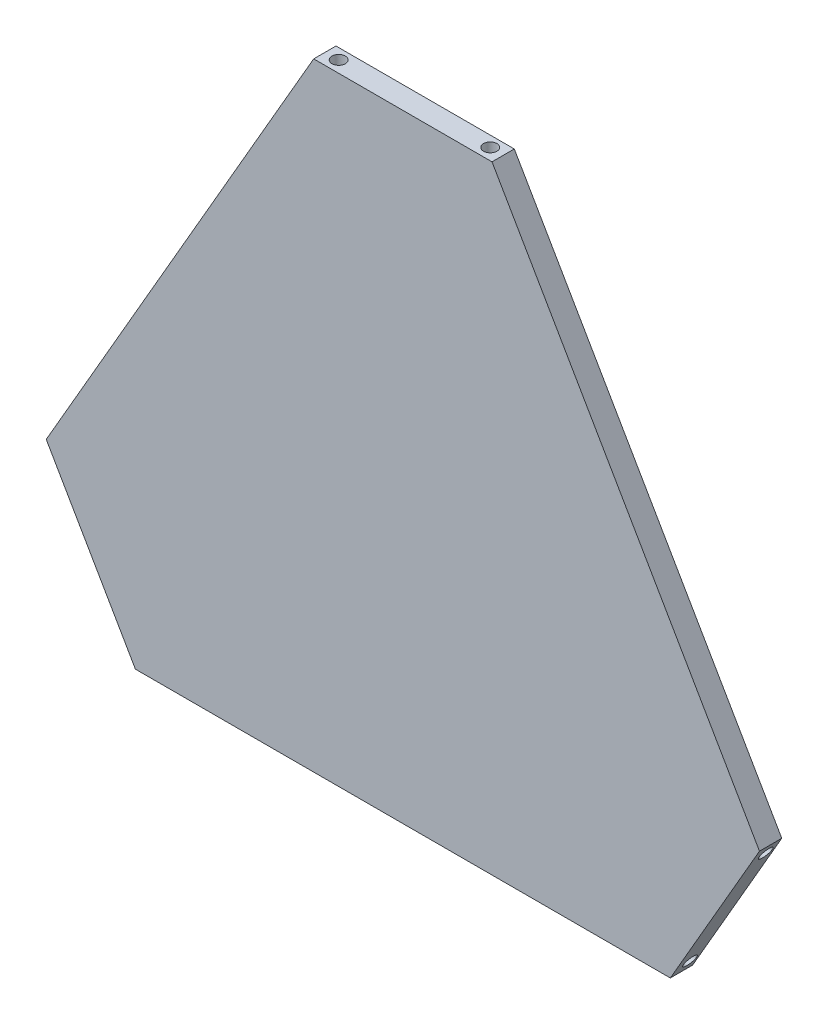
ISO-10303-21;
HEADER;
FILE_DESCRIPTION(('STEP AP214'),'2;1');
FILE_NAME('part.step','',(''),(''),'','','');
FILE_SCHEMA(('AUTOMOTIVE_DESIGN { 1 0 10303 214 1 1 1 1 }'));
ENDSEC;
DATA;
#1=APPLICATION_CONTEXT('core data for automotive mechanical design processes');
#2=APPLICATION_PROTOCOL_DEFINITION('international standard','automotive_design',2000,#1);
#3=PRODUCT_CONTEXT('',#1,'mechanical');
#4=PRODUCT('Part','Part','',(#3));
#5=PRODUCT_RELATED_PRODUCT_CATEGORY('part','',(#4));
#6=PRODUCT_DEFINITION_FORMATION('','',#4);
#7=PRODUCT_DEFINITION_CONTEXT('part definition',#1,'design');
#8=PRODUCT_DEFINITION('design','',#6,#7);
#9=PRODUCT_DEFINITION_SHAPE('','',#8);
#10=(LENGTH_UNIT() NAMED_UNIT(*) SI_UNIT(.MILLI.,.METRE.));
#11=(NAMED_UNIT(*) PLANE_ANGLE_UNIT() SI_UNIT($,.RADIAN.));
#12=(NAMED_UNIT(*) SI_UNIT($,.STERADIAN.) SOLID_ANGLE_UNIT());
#13=UNCERTAINTY_MEASURE_WITH_UNIT(LENGTH_MEASURE(1.E-05),#10,'distance_accuracy_value','');
#14=(GEOMETRIC_REPRESENTATION_CONTEXT(3) GLOBAL_UNCERTAINTY_ASSIGNED_CONTEXT((#13)) GLOBAL_UNIT_ASSIGNED_CONTEXT((#10,
#11,#12)) REPRESENTATION_CONTEXT('',''));
#15=CARTESIAN_POINT('',(0.,0.,0.));
#16=DIRECTION('',(0.,0.,1.));
#17=DIRECTION('',(1.,0.,0.));
#18=AXIS2_PLACEMENT_3D('',#15,#16,#17);
#19=CARTESIAN_POINT('',(-20.,34.6410161513775,5.));
#20=DIRECTION('',(0.866025403784438,0.500000000000001,0.));
#21=DIRECTION('',(-0.500000000000001,0.866025403784438,0.));
#22=AXIS2_PLACEMENT_3D('',#19,#20,#21);
#23=PLANE('',#22);
#24=CARTESIAN_POINT('',(-18.5,32.0429399400242,2.33342692473837));
#25=DIRECTION('',(-0.866025403784439,-0.5,0.));
#26=DIRECTION('',(0.5,-0.866025403784439,0.));
#27=AXIS2_PLACEMENT_3D('',#24,#25,#26);
#28=CIRCLE('',#27,1.5);
#29=CARTESIAN_POINT('',(-17.75,30.7439018343476,2.33342692473837));
#30=VERTEX_POINT('',#29);
#31=EDGE_CURVE('E160',#30,#30,#28,.T.);
#32=ORIENTED_EDGE('',*,*,#31,.F.);
#33=EDGE_LOOP('',(#32));
#34=FACE_BOUND('',#33,.T.);
#35=CARTESIAN_POINT('',(-1.5,2.59807621135332,2.33342692473837));
#36=DIRECTION('',(-0.866025403784439,-0.5,0.));
#37=DIRECTION('',(0.5,-0.866025403784439,0.));
#38=AXIS2_PLACEMENT_3D('',#35,#36,#37);
#39=CIRCLE('',#38,1.5);
#40=CARTESIAN_POINT('',(-0.75,1.29903810567666,2.33342692473837));
#41=VERTEX_POINT('',#40);
#42=EDGE_CURVE('E163',#41,#41,#39,.T.);
#43=ORIENTED_EDGE('',*,*,#42,.F.);
#44=EDGE_LOOP('',(#43));
#45=FACE_BOUND('',#44,.T.);
#46=DIRECTION('',(0.500000000000001,-0.866025403784438,0.));
#47=VECTOR('',#46,1.);
#48=CARTESIAN_POINT('',(-20.,34.6410161513775,0.));
#49=LINE('',#48,#47);
#50=CARTESIAN_POINT('',(-20.,34.6410161513775,0.));
#51=VERTEX_POINT('',#50);
#52=CARTESIAN_POINT('',(0.,0.,0.));
#53=VERTEX_POINT('',#52);
#54=EDGE_CURVE('E116',#51,#53,#49,.T.);
#55=ORIENTED_EDGE('',*,*,#54,.T.);
#56=DIRECTION('',(0.,0.,-1.));
#57=VECTOR('',#56,1.);
#58=CARTESIAN_POINT('',(0.,0.,5.));
#59=LINE('',#58,#57);
#60=CARTESIAN_POINT('',(0.,0.,5.));
#61=VERTEX_POINT('',#60);
#62=EDGE_CURVE('E11',#61,#53,#59,.T.);
#63=ORIENTED_EDGE('',*,*,#62,.F.);
#64=DIRECTION('',(0.500000000000001,-0.866025403784438,0.));
#65=VECTOR('',#64,1.);
#66=CARTESIAN_POINT('',(-20.,34.6410161513775,5.));
#67=LINE('',#66,#65);
#68=CARTESIAN_POINT('',(-20.,34.6410161513775,5.));
#69=VERTEX_POINT('',#68);
#70=EDGE_CURVE('E127',#69,#61,#67,.T.);
#71=ORIENTED_EDGE('',*,*,#70,.F.);
#72=DIRECTION('',(0.,0.,-1.));
#73=VECTOR('',#72,1.);
#74=CARTESIAN_POINT('',(-20.,34.6410161513775,5.));
#75=LINE('',#74,#73);
#76=EDGE_CURVE('E112',#69,#51,#75,.T.);
#77=ORIENTED_EDGE('',*,*,#76,.T.);
#78=EDGE_LOOP('',(#55,#63,#71,#77));
#79=FACE_BOUND('',#78,.T.);
#80=ADVANCED_FACE('F32',(#34,#45,#79),#23,.F.);
#81=CARTESIAN_POINT('',(0.,0.,5.));
#82=DIRECTION('',(0.,1.,0.));
#83=DIRECTION('',(0.,0.,1.));
#84=AXIS2_PLACEMENT_3D('',#81,#82,#83);
#85=PLANE('',#84);
#86=DIRECTION('',(1.,0.,0.));
#87=VECTOR('',#86,1.);
#88=CARTESIAN_POINT('',(0.,0.,0.));
#89=LINE('',#88,#87);
#90=CARTESIAN_POINT('',(120.,0.,0.));
#91=VERTEX_POINT('',#90);
#92=EDGE_CURVE('E119',#53,#91,#89,.T.);
#93=ORIENTED_EDGE('',*,*,#92,.T.);
#94=DIRECTION('',(0.,0.,-1.));
#95=VECTOR('',#94,1.);
#96=CARTESIAN_POINT('',(120.,0.,5.));
#97=LINE('',#96,#95);
#98=CARTESIAN_POINT('',(120.,0.,5.));
#99=VERTEX_POINT('',#98);
#100=EDGE_CURVE('E40',#99,#91,#97,.T.);
#101=ORIENTED_EDGE('',*,*,#100,.F.);
#102=DIRECTION('',(1.,0.,0.));
#103=VECTOR('',#102,1.);
#104=CARTESIAN_POINT('',(0.,0.,5.));
#105=LINE('',#104,#103);
#106=EDGE_CURVE('E85',#61,#99,#105,.T.);
#107=ORIENTED_EDGE('',*,*,#106,.F.);
#108=ORIENTED_EDGE('',*,*,#62,.T.);
#109=EDGE_LOOP('',(#93,#101,#107,#108));
#110=FACE_BOUND('',#109,.T.);
#111=ADVANCED_FACE('F152',(#110),#85,.F.);
#112=CARTESIAN_POINT('',(120.,0.,5.));
#113=DIRECTION('',(-0.866025403784437,0.500000000000003,0.));
#114=DIRECTION('',(-0.500000000000003,-0.866025403784437,0.));
#115=AXIS2_PLACEMENT_3D('',#112,#113,#114);
#116=PLANE('',#115);
#117=CARTESIAN_POINT('',(121.5,2.5980762113533,2.08546633334095));
#118=DIRECTION('',(0.866025403784437,-0.500000000000003,0.));
#119=DIRECTION('',(0.500000000000003,0.866025403784437,0.));
#120=AXIS2_PLACEMENT_3D('',#117,#118,#119);
#121=CIRCLE('',#120,1.5);
#122=CARTESIAN_POINT('',(122.25,3.89711431702996,2.08546633334095));
#123=VERTEX_POINT('',#122);
#124=EDGE_CURVE('E171',#123,#123,#121,.T.);
#125=ORIENTED_EDGE('',*,*,#124,.F.);
#126=EDGE_LOOP('',(#125));
#127=FACE_BOUND('',#126,.T.);
#128=CARTESIAN_POINT('',(138.5,32.0429399400242,2.08546633334095));
#129=DIRECTION('',(0.866025403784437,-0.500000000000003,0.));
#130=DIRECTION('',(0.500000000000003,0.866025403784437,0.));
#131=AXIS2_PLACEMENT_3D('',#128,#129,#130);
#132=CIRCLE('',#131,1.5);
#133=CARTESIAN_POINT('',(139.25,33.3419780457008,2.08546633334095));
#134=VERTEX_POINT('',#133);
#135=EDGE_CURVE('E179',#134,#134,#132,.T.);
#136=ORIENTED_EDGE('',*,*,#135,.F.);
#137=EDGE_LOOP('',(#136));
#138=FACE_BOUND('',#137,.T.);
#139=DIRECTION('',(0.500000000000003,0.866025403784437,0.));
#140=VECTOR('',#139,1.);
#141=CARTESIAN_POINT('',(120.,0.,0.));
#142=LINE('',#141,#140);
#143=CARTESIAN_POINT('',(140.,34.6410161513775,0.));
#144=VERTEX_POINT('',#143);
#145=EDGE_CURVE('E122',#91,#144,#142,.T.);
#146=ORIENTED_EDGE('',*,*,#145,.T.);
#147=DIRECTION('',(0.,0.,-1.));
#148=VECTOR('',#147,1.);
#149=CARTESIAN_POINT('',(140.,34.6410161513775,5.));
#150=LINE('',#149,#148);
#151=CARTESIAN_POINT('',(140.,34.6410161513775,5.));
#152=VERTEX_POINT('',#151);
#153=EDGE_CURVE('E107',#152,#144,#150,.T.);
#154=ORIENTED_EDGE('',*,*,#153,.F.);
#155=DIRECTION('',(0.500000000000003,0.866025403784437,0.));
#156=VECTOR('',#155,1.);
#157=CARTESIAN_POINT('',(120.,0.,5.));
#158=LINE('',#157,#156);
#159=EDGE_CURVE('E98',#99,#152,#158,.T.);
#160=ORIENTED_EDGE('',*,*,#159,.F.);
#161=ORIENTED_EDGE('',*,*,#100,.T.);
#162=EDGE_LOOP('',(#146,#154,#160,#161));
#163=FACE_BOUND('',#162,.T.);
#164=ADVANCED_FACE('F133',(#127,#138,#163),#116,.F.);
#165=CARTESIAN_POINT('',(140.,34.6410161513775,5.));
#166=DIRECTION('',(-0.866025403784439,-0.5,0.));
#167=DIRECTION('',(0.5,-0.866025403784439,0.));
#168=AXIS2_PLACEMENT_3D('',#165,#166,#167);
#169=PLANE('',#168);
#170=DIRECTION('',(-0.499999999999999,0.866025403784439,0.));
#171=VECTOR('',#170,1.);
#172=CARTESIAN_POINT('',(140.,34.6410161513775,0.));
#173=LINE('',#172,#171);
#174=CARTESIAN_POINT('',(80.0000000000002,138.56406460551,0.));
#175=VERTEX_POINT('',#174);
#176=EDGE_CURVE('E106',#144,#175,#173,.T.);
#177=ORIENTED_EDGE('',*,*,#176,.T.);
#178=DIRECTION('',(0.,0.,-1.));
#179=VECTOR('',#178,1.);
#180=CARTESIAN_POINT('',(80.0000000000002,138.56406460551,5.));
#181=LINE('',#180,#179);
#182=CARTESIAN_POINT('',(80.0000000000002,138.56406460551,5.));
#183=VERTEX_POINT('',#182);
#184=EDGE_CURVE('E103',#183,#175,#181,.T.);
#185=ORIENTED_EDGE('',*,*,#184,.F.);
#186=DIRECTION('',(-0.499999999999999,0.866025403784439,0.));
#187=VECTOR('',#186,1.);
#188=CARTESIAN_POINT('',(140.,34.6410161513775,5.));
#189=LINE('',#188,#187);
#190=EDGE_CURVE('E92',#152,#183,#189,.T.);
#191=ORIENTED_EDGE('',*,*,#190,.F.);
#192=ORIENTED_EDGE('',*,*,#153,.T.);
#193=EDGE_LOOP('',(#177,#185,#191,#192));
#194=FACE_BOUND('',#193,.T.);
#195=ADVANCED_FACE('F104',(#194),#169,.F.);
#196=CARTESIAN_POINT('',(80.0000000000002,138.56406460551,5.));
#197=DIRECTION('',(0.,-1.,0.));
#198=DIRECTION('',(1.,0.,0.));
#199=AXIS2_PLACEMENT_3D('',#196,#197,#198);
#200=PLANE('',#199);
#201=CARTESIAN_POINT('',(77.0000000000002,138.56406460551,2.39708812317985));
#202=DIRECTION('',(0.,1.,0.));
#203=DIRECTION('',(-1.,0.,0.));
#204=AXIS2_PLACEMENT_3D('',#201,#202,#203);
#205=CIRCLE('',#204,1.5);
#206=CARTESIAN_POINT('',(75.5000000000002,138.56406460551,2.39708812317985));
#207=VERTEX_POINT('',#206);
#208=EDGE_CURVE('E194',#207,#207,#205,.T.);
#209=ORIENTED_EDGE('',*,*,#208,.F.);
#210=EDGE_LOOP('',(#209));
#211=FACE_BOUND('',#210,.T.);
#212=CARTESIAN_POINT('',(43.0000000000002,138.56406460551,2.39708812317985));
#213=DIRECTION('',(0.,1.,0.));
#214=DIRECTION('',(-1.,0.,0.));
#215=AXIS2_PLACEMENT_3D('',#212,#213,#214);
#216=CIRCLE('',#215,1.5);
#217=CARTESIAN_POINT('',(41.5000000000002,138.56406460551,2.39708812317985));
#218=VERTEX_POINT('',#217);
#219=EDGE_CURVE('E188',#218,#218,#216,.T.);
#220=ORIENTED_EDGE('',*,*,#219,.F.);
#221=EDGE_LOOP('',(#220));
#222=FACE_BOUND('',#221,.T.);
#223=DIRECTION('',(-1.,0.,0.));
#224=VECTOR('',#223,1.);
#225=CARTESIAN_POINT('',(80.0000000000002,138.56406460551,0.));
#226=LINE('',#225,#224);
#227=CARTESIAN_POINT('',(40.0000000000002,138.56406460551,0.));
#228=VERTEX_POINT('',#227);
#229=EDGE_CURVE('E71',#175,#228,#226,.T.);
#230=ORIENTED_EDGE('',*,*,#229,.T.);
#231=DIRECTION('',(0.,0.,-1.));
#232=VECTOR('',#231,1.);
#233=CARTESIAN_POINT('',(40.0000000000002,138.56406460551,5.));
#234=LINE('',#233,#232);
#235=CARTESIAN_POINT('',(40.0000000000002,138.56406460551,5.));
#236=VERTEX_POINT('',#235);
#237=EDGE_CURVE('E108',#236,#228,#234,.T.);
#238=ORIENTED_EDGE('',*,*,#237,.F.);
#239=DIRECTION('',(-1.,0.,0.));
#240=VECTOR('',#239,1.);
#241=CARTESIAN_POINT('',(80.0000000000002,138.56406460551,5.));
#242=LINE('',#241,#240);
#243=EDGE_CURVE('E96',#183,#236,#242,.T.);
#244=ORIENTED_EDGE('',*,*,#243,.F.);
#245=ORIENTED_EDGE('',*,*,#184,.T.);
#246=EDGE_LOOP('',(#230,#238,#244,#245));
#247=FACE_BOUND('',#246,.T.);
#248=ADVANCED_FACE('F110',(#211,#222,#247),#200,.F.);
#249=CARTESIAN_POINT('',(40.0000000000002,138.56406460551,5.));
#250=DIRECTION('',(0.866025403784438,-0.500000000000002,0.));
#251=DIRECTION('',(0.500000000000002,0.866025403784438,0.));
#252=AXIS2_PLACEMENT_3D('',#249,#250,#251);
#253=PLANE('',#252);
#254=DIRECTION('',(-0.500000000000002,-0.866025403784438,0.));
#255=VECTOR('',#254,1.);
#256=CARTESIAN_POINT('',(40.0000000000002,138.56406460551,0.));
#257=LINE('',#256,#255);
#258=EDGE_CURVE('E77',#228,#51,#257,.T.);
#259=ORIENTED_EDGE('',*,*,#258,.T.);
#260=ORIENTED_EDGE('',*,*,#76,.F.);
#261=DIRECTION('',(-0.500000000000002,-0.866025403784438,0.));
#262=VECTOR('',#261,1.);
#263=CARTESIAN_POINT('',(40.0000000000002,138.56406460551,5.));
#264=LINE('',#263,#262);
#265=EDGE_CURVE('E48',#236,#69,#264,.T.);
#266=ORIENTED_EDGE('',*,*,#265,.F.);
#267=ORIENTED_EDGE('',*,*,#237,.T.);
#268=EDGE_LOOP('',(#259,#260,#266,#267));
#269=FACE_BOUND('',#268,.T.);
#270=ADVANCED_FACE('F140',(#269),#253,.F.);
#271=CARTESIAN_POINT('',(0.,0.,5.));
#272=DIRECTION('',(0.,0.,1.));
#273=DIRECTION('',(1.,0.,0.));
#274=AXIS2_PLACEMENT_3D('',#271,#272,#273);
#275=PLANE('',#274);
#276=ORIENTED_EDGE('',*,*,#70,.T.);
#277=ORIENTED_EDGE('',*,*,#106,.T.);
#278=ORIENTED_EDGE('',*,*,#159,.T.);
#279=ORIENTED_EDGE('',*,*,#190,.T.);
#280=ORIENTED_EDGE('',*,*,#243,.T.);
#281=ORIENTED_EDGE('',*,*,#265,.T.);
#282=EDGE_LOOP('',(#276,#277,#278,#279,#280,#281));
#283=FACE_BOUND('',#282,.T.);
#284=ADVANCED_FACE('F94',(#283),#275,.T.);
#285=CARTESIAN_POINT('',(0.,0.,0.));
#286=DIRECTION('',(0.,0.,1.));
#287=DIRECTION('',(1.,0.,0.));
#288=AXIS2_PLACEMENT_3D('',#285,#286,#287);
#289=PLANE('',#288);
#290=ORIENTED_EDGE('',*,*,#54,.F.);
#291=ORIENTED_EDGE('',*,*,#258,.F.);
#292=ORIENTED_EDGE('',*,*,#229,.F.);
#293=ORIENTED_EDGE('',*,*,#176,.F.);
#294=ORIENTED_EDGE('',*,*,#145,.F.);
#295=ORIENTED_EDGE('',*,*,#92,.F.);
#296=EDGE_LOOP('',(#290,#291,#292,#293,#294,#295));
#297=FACE_BOUND('',#296,.T.);
#298=ADVANCED_FACE('F136',(#297),#289,.F.);
#299=CARTESIAN_POINT('',(1.09807621135332,4.09807621135332,2.33342692473837));
#300=DIRECTION('',(-0.866025403784439,-0.5,0.));
#301=DIRECTION('',(0.5,-0.866025403784439,0.));
#302=AXIS2_PLACEMENT_3D('',#299,#300,#301);
#303=CYLINDRICAL_SURFACE('',#302,1.5);
#304=CARTESIAN_POINT('',(1.09807621135332,4.09807621135332,2.33342692473837));
#305=DIRECTION('',(-0.866025403784439,-0.5,0.));
#306=DIRECTION('',(0.5,-0.866025403784439,0.));
#307=AXIS2_PLACEMENT_3D('',#304,#305,#306);
#308=CIRCLE('',#307,1.5);
#309=CARTESIAN_POINT('',(1.84807621135332,2.79903810567666,2.33342692473837));
#310=VERTEX_POINT('',#309);
#311=EDGE_CURVE('E165',#310,#310,#308,.T.);
#312=ORIENTED_EDGE('',*,*,#311,.F.);
#313=EDGE_LOOP('',(#312));
#314=FACE_BOUND('',#313,.T.);
#315=ORIENTED_EDGE('',*,*,#42,.T.);
#316=EDGE_LOOP('',(#315));
#317=FACE_BOUND('',#316,.T.);
#318=ADVANCED_FACE('F249',(#314,#317),#303,.F.);
#319=CARTESIAN_POINT('',(1.09807621135332,4.09807621135332,2.33342692473837));
#320=DIRECTION('',(-0.866025403784439,-0.5,0.));
#321=DIRECTION('',(0.5,-0.866025403784439,0.));
#322=AXIS2_PLACEMENT_3D('',#319,#320,#321);
#323=PLANE('',#322);
#324=ORIENTED_EDGE('',*,*,#311,.T.);
#325=EDGE_LOOP('',(#324));
#326=FACE_BOUND('',#325,.T.);
#327=ADVANCED_FACE('F245',(#326),#323,.T.);
#328=CARTESIAN_POINT('',(-15.9019237886467,33.5429399400242,2.33342692473837));
#329=DIRECTION('',(-0.866025403784439,-0.5,0.));
#330=DIRECTION('',(0.5,-0.866025403784439,0.));
#331=AXIS2_PLACEMENT_3D('',#328,#329,#330);
#332=CYLINDRICAL_SURFACE('',#331,1.5);
#333=CARTESIAN_POINT('',(-15.9019237886467,33.5429399400242,2.33342692473837));
#334=DIRECTION('',(-0.866025403784439,-0.5,0.));
#335=DIRECTION('',(0.5,-0.866025403784439,0.));
#336=AXIS2_PLACEMENT_3D('',#333,#334,#335);
#337=CIRCLE('',#336,1.5);
#338=CARTESIAN_POINT('',(-15.1519237886467,32.2439018343476,2.33342692473837));
#339=VERTEX_POINT('',#338);
#340=EDGE_CURVE('E120',#339,#339,#337,.T.);
#341=ORIENTED_EDGE('',*,*,#340,.F.);
#342=EDGE_LOOP('',(#341));
#343=FACE_BOUND('',#342,.T.);
#344=ORIENTED_EDGE('',*,*,#31,.T.);
#345=EDGE_LOOP('',(#344));
#346=FACE_BOUND('',#345,.T.);
#347=ADVANCED_FACE('F241',(#343,#346),#332,.F.);
#348=CARTESIAN_POINT('',(-15.9019237886467,33.5429399400242,2.33342692473837));
#349=DIRECTION('',(-0.866025403784439,-0.5,0.));
#350=DIRECTION('',(0.5,-0.866025403784439,0.));
#351=AXIS2_PLACEMENT_3D('',#348,#349,#350);
#352=PLANE('',#351);
#353=ORIENTED_EDGE('',*,*,#340,.T.);
#354=EDGE_LOOP('',(#353));
#355=FACE_BOUND('',#354,.T.);
#356=ADVANCED_FACE('F237',(#355),#352,.T.);
#357=CARTESIAN_POINT('',(135.901923788647,33.5429399400242,2.08546633334095));
#358=DIRECTION('',(0.866025403784437,-0.500000000000003,0.));
#359=DIRECTION('',(0.500000000000003,0.866025403784437,0.));
#360=AXIS2_PLACEMENT_3D('',#357,#358,#359);
#361=CYLINDRICAL_SURFACE('',#360,1.5);
#362=CARTESIAN_POINT('',(135.901923788647,33.5429399400242,2.08546633334095));
#363=DIRECTION('',(0.866025403784437,-0.500000000000003,0.));
#364=DIRECTION('',(0.500000000000003,0.866025403784437,0.));
#365=AXIS2_PLACEMENT_3D('',#362,#363,#364);
#366=CIRCLE('',#365,1.5);
#367=CARTESIAN_POINT('',(136.651923788647,34.8419780457008,2.08546633334095));
#368=VERTEX_POINT('',#367);
#369=EDGE_CURVE('E182',#368,#368,#366,.T.);
#370=ORIENTED_EDGE('',*,*,#369,.F.);
#371=EDGE_LOOP('',(#370));
#372=FACE_BOUND('',#371,.T.);
#373=ORIENTED_EDGE('',*,*,#135,.T.);
#374=EDGE_LOOP('',(#373));
#375=FACE_BOUND('',#374,.T.);
#376=ADVANCED_FACE('F233',(#372,#375),#361,.F.);
#377=CARTESIAN_POINT('',(135.901923788647,33.5429399400242,2.08546633334095));
#378=DIRECTION('',(0.866025403784437,-0.500000000000003,0.));
#379=DIRECTION('',(0.500000000000003,0.866025403784437,0.));
#380=AXIS2_PLACEMENT_3D('',#377,#378,#379);
#381=PLANE('',#380);
#382=ORIENTED_EDGE('',*,*,#369,.T.);
#383=EDGE_LOOP('',(#382));
#384=FACE_BOUND('',#383,.T.);
#385=ADVANCED_FACE('F229',(#384),#381,.T.);
#386=CARTESIAN_POINT('',(118.901923788647,4.09807621135331,2.08546633334095));
#387=DIRECTION('',(0.866025403784437,-0.500000000000003,0.));
#388=DIRECTION('',(0.500000000000003,0.866025403784437,0.));
#389=AXIS2_PLACEMENT_3D('',#386,#387,#388);
#390=CYLINDRICAL_SURFACE('',#389,1.5);
#391=CARTESIAN_POINT('',(118.901923788647,4.09807621135331,2.08546633334095));
#392=DIRECTION('',(0.866025403784437,-0.500000000000003,0.));
#393=DIRECTION('',(0.500000000000003,0.866025403784437,0.));
#394=AXIS2_PLACEMENT_3D('',#391,#392,#393);
#395=CIRCLE('',#394,1.5);
#396=CARTESIAN_POINT('',(119.651923788647,5.39711431702997,2.08546633334095));
#397=VERTEX_POINT('',#396);
#398=EDGE_CURVE('E166',#397,#397,#395,.T.);
#399=ORIENTED_EDGE('',*,*,#398,.F.);
#400=EDGE_LOOP('',(#399));
#401=FACE_BOUND('',#400,.T.);
#402=ORIENTED_EDGE('',*,*,#124,.T.);
#403=EDGE_LOOP('',(#402));
#404=FACE_BOUND('',#403,.T.);
#405=ADVANCED_FACE('F222',(#401,#404),#390,.F.);
#406=CARTESIAN_POINT('',(118.901923788647,4.09807621135331,2.08546633334095));
#407=DIRECTION('',(0.866025403784437,-0.500000000000003,0.));
#408=DIRECTION('',(0.500000000000003,0.866025403784437,0.));
#409=AXIS2_PLACEMENT_3D('',#406,#407,#408);
#410=PLANE('',#409);
#411=ORIENTED_EDGE('',*,*,#398,.T.);
#412=EDGE_LOOP('',(#411));
#413=FACE_BOUND('',#412,.T.);
#414=ADVANCED_FACE('F213',(#413),#410,.T.);
#415=CARTESIAN_POINT('',(43.0000000000002,135.56406460551,2.39708812317985));
#416=DIRECTION('',(0.,1.,0.));
#417=DIRECTION('',(-1.,0.,0.));
#418=AXIS2_PLACEMENT_3D('',#415,#416,#417);
#419=CYLINDRICAL_SURFACE('',#418,1.5);
#420=CARTESIAN_POINT('',(43.0000000000002,135.56406460551,2.39708812317985));
#421=DIRECTION('',(0.,1.,0.));
#422=DIRECTION('',(-1.,0.,0.));
#423=AXIS2_PLACEMENT_3D('',#420,#421,#422);
#424=CIRCLE('',#423,1.5);
#425=CARTESIAN_POINT('',(41.5000000000002,135.56406460551,2.39708812317985));
#426=VERTEX_POINT('',#425);
#427=EDGE_CURVE('E191',#426,#426,#424,.T.);
#428=ORIENTED_EDGE('',*,*,#427,.F.);
#429=EDGE_LOOP('',(#428));
#430=FACE_BOUND('',#429,.T.);
#431=ORIENTED_EDGE('',*,*,#219,.T.);
#432=EDGE_LOOP('',(#431));
#433=FACE_BOUND('',#432,.T.);
#434=ADVANCED_FACE('F211',(#430,#433),#419,.F.);
#435=CARTESIAN_POINT('',(43.0000000000002,135.56406460551,2.39708812317985));
#436=DIRECTION('',(0.,1.,0.));
#437=DIRECTION('',(-1.,0.,0.));
#438=AXIS2_PLACEMENT_3D('',#435,#436,#437);
#439=PLANE('',#438);
#440=ORIENTED_EDGE('',*,*,#427,.T.);
#441=EDGE_LOOP('',(#440));
#442=FACE_BOUND('',#441,.T.);
#443=ADVANCED_FACE('F205',(#442),#439,.T.);
#444=CARTESIAN_POINT('',(77.0000000000002,135.56406460551,2.39708812317985));
#445=DIRECTION('',(0.,1.,0.));
#446=DIRECTION('',(-1.,0.,0.));
#447=AXIS2_PLACEMENT_3D('',#444,#445,#446);
#448=CYLINDRICAL_SURFACE('',#447,1.5);
#449=CARTESIAN_POINT('',(77.0000000000002,135.56406460551,2.39708812317985));
#450=DIRECTION('',(0.,1.,0.));
#451=DIRECTION('',(-1.,0.,0.));
#452=AXIS2_PLACEMENT_3D('',#449,#450,#451);
#453=CIRCLE('',#452,1.5);
#454=CARTESIAN_POINT('',(75.5000000000002,135.56406460551,2.39708812317985));
#455=VERTEX_POINT('',#454);
#456=EDGE_CURVE('E183',#455,#455,#453,.T.);
#457=ORIENTED_EDGE('',*,*,#456,.F.);
#458=EDGE_LOOP('',(#457));
#459=FACE_BOUND('',#458,.T.);
#460=ORIENTED_EDGE('',*,*,#208,.T.);
#461=EDGE_LOOP('',(#460));
#462=FACE_BOUND('',#461,.T.);
#463=ADVANCED_FACE('F202',(#459,#462),#448,.F.);
#464=CARTESIAN_POINT('',(77.0000000000002,135.56406460551,2.39708812317985));
#465=DIRECTION('',(0.,1.,0.));
#466=DIRECTION('',(-1.,0.,0.));
#467=AXIS2_PLACEMENT_3D('',#464,#465,#466);
#468=PLANE('',#467);
#469=ORIENTED_EDGE('',*,*,#456,.T.);
#470=EDGE_LOOP('',(#469));
#471=FACE_BOUND('',#470,.T.);
#472=ADVANCED_FACE('F200',(#471),#468,.T.);
#473=CLOSED_SHELL('',(#80,#111,#164,#195,#248,#270,#284,#298,#318,#327,#347,#356,#376,#385,#405,
#414,#434,#443,#463,#472));
#474=MANIFOLD_SOLID_BREP('B2',#473);
#475=ADVANCED_BREP_SHAPE_REPRESENTATION('',(#18,#474),#14);
#476=SHAPE_DEFINITION_REPRESENTATION(#9,#475);
ENDSEC;
END-ISO-10303-21;
